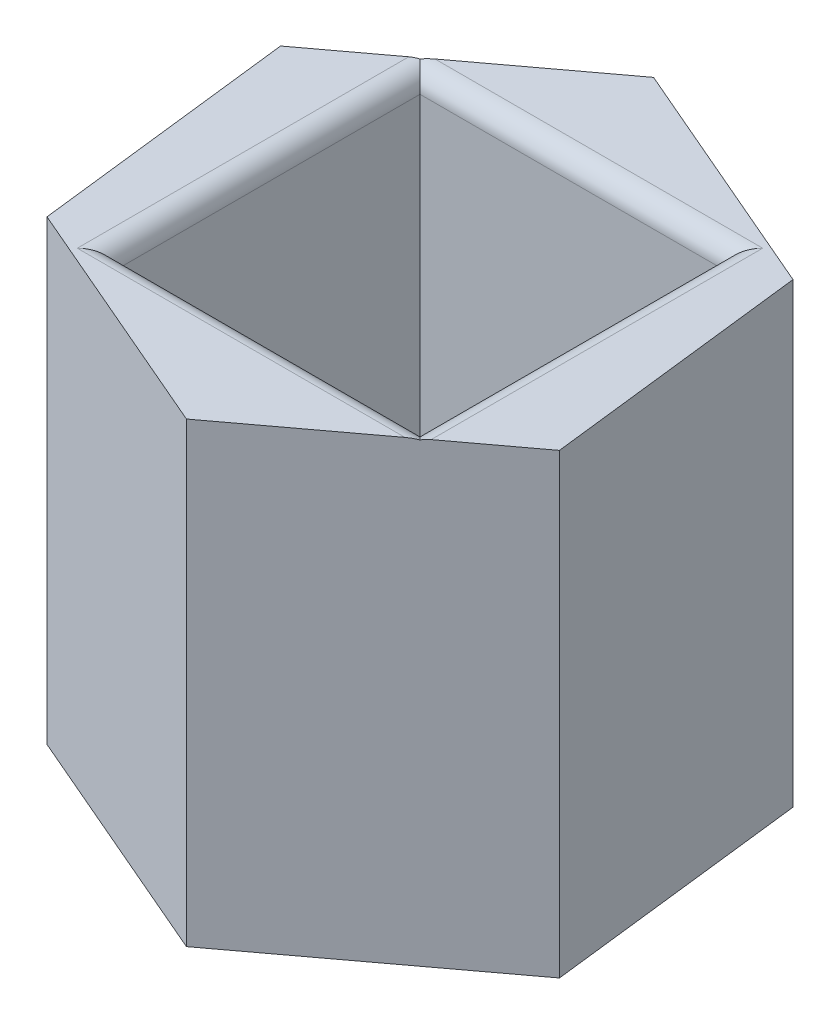
ISO-10303-21;
HEADER;
FILE_DESCRIPTION(('STEP AP214'),'2;1');
FILE_NAME('part.step','',(''),(''),'','','');
FILE_SCHEMA(('AUTOMOTIVE_DESIGN { 1 0 10303 214 1 1 1 1 }'));
ENDSEC;
DATA;
#1=APPLICATION_CONTEXT('core data for automotive mechanical design processes');
#2=APPLICATION_PROTOCOL_DEFINITION('international standard','automotive_design',2000,#1);
#3=PRODUCT_CONTEXT('',#1,'mechanical');
#4=PRODUCT('Part','Part','',(#3));
#5=PRODUCT_RELATED_PRODUCT_CATEGORY('part','',(#4));
#6=PRODUCT_DEFINITION_FORMATION('','',#4);
#7=PRODUCT_DEFINITION_CONTEXT('part definition',#1,'design');
#8=PRODUCT_DEFINITION('design','',#6,#7);
#9=PRODUCT_DEFINITION_SHAPE('','',#8);
#10=(LENGTH_UNIT() NAMED_UNIT(*) SI_UNIT(.MILLI.,.METRE.));
#11=(NAMED_UNIT(*) PLANE_ANGLE_UNIT() SI_UNIT($,.RADIAN.));
#12=(NAMED_UNIT(*) SI_UNIT($,.STERADIAN.) SOLID_ANGLE_UNIT());
#13=UNCERTAINTY_MEASURE_WITH_UNIT(LENGTH_MEASURE(1.E-05),#10,'distance_accuracy_value','');
#14=(GEOMETRIC_REPRESENTATION_CONTEXT(3) GLOBAL_UNCERTAINTY_ASSIGNED_CONTEXT((#13)) GLOBAL_UNIT_ASSIGNED_CONTEXT((#10,
#11,#12)) REPRESENTATION_CONTEXT('',''));
#15=CARTESIAN_POINT('',(0.,0.,0.));
#16=DIRECTION('',(0.,0.,1.));
#17=DIRECTION('',(1.,0.,0.));
#18=AXIS2_PLACEMENT_3D('',#15,#16,#17);
#19=CARTESIAN_POINT('',(0.,6.,0.));
#20=DIRECTION('',(0.,1.,0.));
#21=DIRECTION('',(0.,0.,1.));
#22=AXIS2_PLACEMENT_3D('',#19,#20,#21);
#23=PLANE('',#22);
#24=DIRECTION('',(1.,0.,0.));
#25=VECTOR('',#24,1.);
#26=CARTESIAN_POINT('',(0.,6.,-2.25));
#27=LINE('',#26,#25);
#28=CARTESIAN_POINT('',(-2.05318407785259,6.,-2.25));
#29=VERTEX_POINT('',#28);
#30=CARTESIAN_POINT('',(2.25,6.,-2.25));
#31=VERTEX_POINT('',#30);
#32=EDGE_CURVE('E289',#29,#31,#27,.T.);
#33=ORIENTED_EDGE('',*,*,#32,.T.);
#34=DIRECTION('',(0.,0.,-1.));
#35=VECTOR('',#34,1.);
#36=CARTESIAN_POINT('',(2.25,6.,2.));
#37=LINE('',#36,#35);
#38=CARTESIAN_POINT('',(2.25,6.,2.1032376772573));
#39=VERTEX_POINT('',#38);
#40=EDGE_CURVE('E292',#31,#39,#37,.F.);
#41=ORIENTED_EDGE('',*,*,#40,.T.);
#42=DIRECTION('',(0.801658028534698,0.,-0.597782908158021));
#43=VECTOR('',#42,1.);
#44=CARTESIAN_POINT('',(0.409031595509729,6.,3.47601685178233));
#45=LINE('',#44,#43);
#46=CARTESIAN_POINT('',(3.21483469538117,6.,1.38377667322926));
#47=VERTEX_POINT('',#46);
#48=EDGE_CURVE('E215',#39,#47,#45,.T.);
#49=ORIENTED_EDGE('',*,*,#48,.T.);
#50=DIRECTION('',(-0.116866170145637,0.,-0.99314767193781));
#51=VECTOR('',#50,1.);
#52=CARTESIAN_POINT('',(3.21483469538117,6.,1.38377667322926));
#53=LINE('',#52,#51);
#54=CARTESIAN_POINT('',(2.80580309987144,6.,-2.09224017855307));
#55=VERTEX_POINT('',#54);
#56=EDGE_CURVE('E214',#47,#55,#53,.T.);
#57=ORIENTED_EDGE('',*,*,#56,.T.);
#58=DIRECTION('',(-0.918524198680335,0.,-0.395364763779788));
#59=VECTOR('',#58,1.);
#60=CARTESIAN_POINT('',(2.80580309987144,6.,-2.09224017855307));
#61=LINE('',#60,#59);
#62=CARTESIAN_POINT('',(-0.409031595509729,6.,-3.47601685178233));
#63=VERTEX_POINT('',#62);
#64=EDGE_CURVE('E218',#55,#63,#61,.T.);
#65=ORIENTED_EDGE('',*,*,#64,.T.);
#66=DIRECTION('',(-0.801658028534698,0.,0.597782908158021));
#67=VECTOR('',#66,1.);
#68=CARTESIAN_POINT('',(-0.409031595509729,6.,-3.47601685178233));
#69=LINE('',#68,#67);
#70=EDGE_CURVE('E222',#63,#29,#69,.T.);
#71=ORIENTED_EDGE('',*,*,#70,.T.);
#72=EDGE_LOOP('',(#33,#41,#49,#57,#65,#71));
#73=FACE_BOUND('',#72,.T.);
#74=ADVANCED_FACE('F60',(#73),#23,.T.);
#75=CARTESIAN_POINT('',(0.409031595509729,6.,3.47601685178233));
#76=DIRECTION('',(-0.597782908158021,0.,-0.801658028534698));
#77=DIRECTION('',(-0.801658028534698,0.,0.597782908158021));
#78=AXIS2_PLACEMENT_3D('',#75,#76,#77);
#79=PLANE('',#78);
#80=CARTESIAN_POINT('',(2.25,5.75,2.1032376772573));
#81=DIRECTION('',(-0.597782908158021,0.,-0.801658028534698));
#82=DIRECTION('',(-0.801658028534698,0.,0.597782908158021));
#83=AXIS2_PLACEMENT_3D('',#80,#81,#82);
#84=ELLIPSE('',#83,0.311853672141174,0.25);
#85=CARTESIAN_POINT('',(2.1659284316842,5.98543995285618,2.1659284316842));
#86=VERTEX_POINT('',#85);
#87=EDGE_CURVE('E276',#39,#86,#84,.F.);
#88=ORIENTED_EDGE('',*,*,#87,.T.);
#89=CARTESIAN_POINT('',(2.05318407785259,5.75,2.25));
#90=DIRECTION('',(-0.597782908158021,0.,-0.801658028534698));
#91=DIRECTION('',(-0.801658028534698,0.,0.597782908158021));
#92=AXIS2_PLACEMENT_3D('',#89,#90,#91);
#93=ELLIPSE('',#92,0.418212024111458,0.25);
#94=CARTESIAN_POINT('',(2.05318407785259,6.,2.25));
#95=VERTEX_POINT('',#94);
#96=EDGE_CURVE('E279',#86,#95,#93,.F.);
#97=ORIENTED_EDGE('',*,*,#96,.T.);
#98=CARTESIAN_POINT('',(0.409031595509729,6.,3.47601685178233));
#99=VERTEX_POINT('',#98);
#100=EDGE_CURVE('E210',#99,#95,#45,.T.);
#101=ORIENTED_EDGE('',*,*,#100,.F.);
#102=DIRECTION('',(0.,-1.,0.));
#103=VECTOR('',#102,1.);
#104=CARTESIAN_POINT('',(0.409031595509729,6.,3.47601685178233));
#105=LINE('',#104,#103);
#106=CARTESIAN_POINT('',(0.409031595509729,0.,3.47601685178233));
#107=VERTEX_POINT('',#106);
#108=EDGE_CURVE('E232',#99,#107,#105,.T.);
#109=ORIENTED_EDGE('',*,*,#108,.T.);
#110=DIRECTION('',(0.801658028534698,0.,-0.597782908158021));
#111=VECTOR('',#110,1.);
#112=CARTESIAN_POINT('',(0.409031595509729,0.,3.47601685178233));
#113=LINE('',#112,#111);
#114=CARTESIAN_POINT('',(3.21483469538117,0.,1.38377667322926));
#115=VERTEX_POINT('',#114);
#116=EDGE_CURVE('E204',#107,#115,#113,.T.);
#117=ORIENTED_EDGE('',*,*,#116,.T.);
#118=DIRECTION('',(0.,-1.,0.));
#119=VECTOR('',#118,1.);
#120=CARTESIAN_POINT('',(3.21483469538117,6.,1.38377667322926));
#121=LINE('',#120,#119);
#122=EDGE_CURVE('E270',#47,#115,#121,.T.);
#123=ORIENTED_EDGE('',*,*,#122,.F.);
#124=ORIENTED_EDGE('',*,*,#48,.F.);
#125=EDGE_LOOP('',(#88,#97,#101,#109,#117,#123,#124));
#126=FACE_BOUND('',#125,.T.);
#127=ADVANCED_FACE('F338',(#126),#79,.F.);
#128=CARTESIAN_POINT('',(3.21483469538117,6.,1.38377667322926));
#129=DIRECTION('',(-0.99314767193781,0.,0.116866170145637));
#130=DIRECTION('',(0.116866170145637,0.,0.99314767193781));
#131=AXIS2_PLACEMENT_3D('',#128,#129,#130);
#132=PLANE('',#131);
#133=DIRECTION('',(-0.116866170145637,0.,-0.99314767193781));
#134=VECTOR('',#133,1.);
#135=CARTESIAN_POINT('',(3.21483469538117,0.,1.38377667322926));
#136=LINE('',#135,#134);
#137=CARTESIAN_POINT('',(2.80580309987144,0.,-2.09224017855307));
#138=VERTEX_POINT('',#137);
#139=EDGE_CURVE('E236',#115,#138,#136,.T.);
#140=ORIENTED_EDGE('',*,*,#139,.T.);
#141=DIRECTION('',(0.,-1.,0.));
#142=VECTOR('',#141,1.);
#143=CARTESIAN_POINT('',(2.80580309987144,6.,-2.09224017855307));
#144=LINE('',#143,#142);
#145=EDGE_CURVE('E266',#55,#138,#144,.T.);
#146=ORIENTED_EDGE('',*,*,#145,.F.);
#147=ORIENTED_EDGE('',*,*,#56,.F.);
#148=ORIENTED_EDGE('',*,*,#122,.T.);
#149=EDGE_LOOP('',(#140,#146,#147,#148));
#150=FACE_BOUND('',#149,.T.);
#151=ADVANCED_FACE('F346',(#150),#132,.F.);
#152=CARTESIAN_POINT('',(2.80580309987144,6.,-2.09224017855307));
#153=DIRECTION('',(-0.395364763779788,0.,0.918524198680335));
#154=DIRECTION('',(0.918524198680335,0.,0.395364763779788));
#155=AXIS2_PLACEMENT_3D('',#152,#153,#154);
#156=PLANE('',#155);
#157=DIRECTION('',(-0.918524198680335,0.,-0.395364763779788));
#158=VECTOR('',#157,1.);
#159=CARTESIAN_POINT('',(2.80580309987144,0.,-2.09224017855307));
#160=LINE('',#159,#158);
#161=CARTESIAN_POINT('',(-0.409031595509729,0.,-3.47601685178233));
#162=VERTEX_POINT('',#161);
#163=EDGE_CURVE('E239',#138,#162,#160,.T.);
#164=ORIENTED_EDGE('',*,*,#163,.T.);
#165=DIRECTION('',(0.,-1.,0.));
#166=VECTOR('',#165,1.);
#167=CARTESIAN_POINT('',(-0.409031595509729,6.,-3.47601685178233));
#168=LINE('',#167,#166);
#169=EDGE_CURVE('E262',#63,#162,#168,.T.);
#170=ORIENTED_EDGE('',*,*,#169,.F.);
#171=ORIENTED_EDGE('',*,*,#64,.F.);
#172=ORIENTED_EDGE('',*,*,#145,.T.);
#173=EDGE_LOOP('',(#164,#170,#171,#172));
#174=FACE_BOUND('',#173,.T.);
#175=ADVANCED_FACE('F389',(#174),#156,.F.);
#176=CARTESIAN_POINT('',(-0.409031595509729,6.,-3.47601685178233));
#177=DIRECTION('',(0.597782908158021,0.,0.801658028534698));
#178=DIRECTION('',(0.801658028534698,0.,-0.597782908158021));
#179=AXIS2_PLACEMENT_3D('',#176,#177,#178);
#180=PLANE('',#179);
#181=CARTESIAN_POINT('',(-2.25,5.75,-2.1032376772573));
#182=DIRECTION('',(0.597782908158021,0.,0.801658028534698));
#183=DIRECTION('',(0.801658028534698,0.,-0.597782908158021));
#184=AXIS2_PLACEMENT_3D('',#181,#182,#183);
#185=ELLIPSE('',#184,0.311853672141174,0.25);
#186=CARTESIAN_POINT('',(-2.25,6.,-2.1032376772573));
#187=VERTEX_POINT('',#186);
#188=CARTESIAN_POINT('',(-2.1659284316842,5.98543995285618,-2.1659284316842));
#189=VERTEX_POINT('',#188);
#190=EDGE_CURVE('E78',#187,#189,#185,.F.);
#191=ORIENTED_EDGE('',*,*,#190,.T.);
#192=CARTESIAN_POINT('',(-2.05318407785259,5.75,-2.25));
#193=DIRECTION('',(0.597782908158021,0.,0.801658028534698));
#194=DIRECTION('',(0.801658028534698,0.,-0.597782908158021));
#195=AXIS2_PLACEMENT_3D('',#192,#193,#194);
#196=ELLIPSE('',#195,0.418212024111458,0.25);
#197=EDGE_CURVE('E70',#189,#29,#196,.F.);
#198=ORIENTED_EDGE('',*,*,#197,.T.);
#199=ORIENTED_EDGE('',*,*,#70,.F.);
#200=ORIENTED_EDGE('',*,*,#169,.T.);
#201=DIRECTION('',(-0.801658028534698,0.,0.597782908158021));
#202=VECTOR('',#201,1.);
#203=CARTESIAN_POINT('',(-0.409031595509729,0.,-3.47601685178233));
#204=LINE('',#203,#202);
#205=CARTESIAN_POINT('',(-3.21483469538117,0.,-1.38377667322926));
#206=VERTEX_POINT('',#205);
#207=EDGE_CURVE('E242',#162,#206,#204,.T.);
#208=ORIENTED_EDGE('',*,*,#207,.T.);
#209=DIRECTION('',(0.,-1.,0.));
#210=VECTOR('',#209,1.);
#211=CARTESIAN_POINT('',(-3.21483469538117,6.,-1.38377667322926));
#212=LINE('',#211,#210);
#213=CARTESIAN_POINT('',(-3.21483469538117,6.,-1.38377667322926));
#214=VERTEX_POINT('',#213);
#215=EDGE_CURVE('E258',#214,#206,#212,.T.);
#216=ORIENTED_EDGE('',*,*,#215,.F.);
#217=EDGE_CURVE('E221',#187,#214,#69,.T.);
#218=ORIENTED_EDGE('',*,*,#217,.F.);
#219=EDGE_LOOP('',(#191,#198,#199,#200,#208,#216,#218));
#220=FACE_BOUND('',#219,.T.);
#221=ADVANCED_FACE('F373',(#220),#180,.F.);
#222=CARTESIAN_POINT('',(-3.21483469538117,6.,-1.38377667322926));
#223=DIRECTION('',(0.99314767193781,0.,-0.116866170145637));
#224=DIRECTION('',(-0.116866170145637,0.,-0.99314767193781));
#225=AXIS2_PLACEMENT_3D('',#222,#223,#224);
#226=PLANE('',#225);
#227=DIRECTION('',(0.116866170145637,0.,0.99314767193781));
#228=VECTOR('',#227,1.);
#229=CARTESIAN_POINT('',(-3.21483469538117,0.,-1.38377667322926));
#230=LINE('',#229,#228);
#231=CARTESIAN_POINT('',(-2.80580309987144,0.,2.09224017855307));
#232=VERTEX_POINT('',#231);
#233=EDGE_CURVE('E245',#206,#232,#230,.T.);
#234=ORIENTED_EDGE('',*,*,#233,.T.);
#235=DIRECTION('',(0.,-1.,0.));
#236=VECTOR('',#235,1.);
#237=CARTESIAN_POINT('',(-2.80580309987144,6.,2.09224017855307));
#238=LINE('',#237,#236);
#239=CARTESIAN_POINT('',(-2.80580309987144,6.,2.09224017855307));
#240=VERTEX_POINT('',#239);
#241=EDGE_CURVE('E254',#240,#232,#238,.T.);
#242=ORIENTED_EDGE('',*,*,#241,.F.);
#243=DIRECTION('',(0.116866170145637,0.,0.99314767193781));
#244=VECTOR('',#243,1.);
#245=CARTESIAN_POINT('',(-3.21483469538117,6.,-1.38377667322926));
#246=LINE('',#245,#244);
#247=EDGE_CURVE('E226',#214,#240,#246,.T.);
#248=ORIENTED_EDGE('',*,*,#247,.F.);
#249=ORIENTED_EDGE('',*,*,#215,.T.);
#250=EDGE_LOOP('',(#234,#242,#248,#249));
#251=FACE_BOUND('',#250,.T.);
#252=ADVANCED_FACE('F362',(#251),#226,.F.);
#253=CARTESIAN_POINT('',(-2.80580309987144,6.,2.09224017855307));
#254=DIRECTION('',(0.395364763779788,0.,-0.918524198680335));
#255=DIRECTION('',(-0.918524198680335,0.,-0.395364763779788));
#256=AXIS2_PLACEMENT_3D('',#253,#254,#255);
#257=PLANE('',#256);
#258=DIRECTION('',(0.918524198680335,0.,0.395364763779788));
#259=VECTOR('',#258,1.);
#260=CARTESIAN_POINT('',(-2.80580309987144,0.,2.09224017855307));
#261=LINE('',#260,#259);
#262=EDGE_CURVE('E248',#232,#107,#261,.T.);
#263=ORIENTED_EDGE('',*,*,#262,.T.);
#264=ORIENTED_EDGE('',*,*,#108,.F.);
#265=DIRECTION('',(0.918524198680335,0.,0.395364763779788));
#266=VECTOR('',#265,1.);
#267=CARTESIAN_POINT('',(-2.80580309987144,6.,2.09224017855307));
#268=LINE('',#267,#266);
#269=EDGE_CURVE('E229',#240,#99,#268,.T.);
#270=ORIENTED_EDGE('',*,*,#269,.F.);
#271=ORIENTED_EDGE('',*,*,#241,.T.);
#272=EDGE_LOOP('',(#263,#264,#270,#271));
#273=FACE_BOUND('',#272,.T.);
#274=ADVANCED_FACE('F353',(#273),#257,.F.);
#275=ORIENTED_EDGE('',*,*,#100,.T.);
#276=DIRECTION('',(1.,0.,0.));
#277=VECTOR('',#276,1.);
#278=CARTESIAN_POINT('',(-2.,6.,2.25));
#279=LINE('',#278,#277);
#280=CARTESIAN_POINT('',(-2.25,6.,2.25));
#281=VERTEX_POINT('',#280);
#282=EDGE_CURVE('E285',#95,#281,#279,.F.);
#283=ORIENTED_EDGE('',*,*,#282,.T.);
#284=DIRECTION('',(0.,0.,-1.));
#285=VECTOR('',#284,1.);
#286=CARTESIAN_POINT('',(-2.25,6.,0.));
#287=LINE('',#286,#285);
#288=EDGE_CURVE('E282',#281,#187,#287,.T.);
#289=ORIENTED_EDGE('',*,*,#288,.T.);
#290=ORIENTED_EDGE('',*,*,#217,.T.);
#291=ORIENTED_EDGE('',*,*,#247,.T.);
#292=ORIENTED_EDGE('',*,*,#269,.T.);
#293=EDGE_LOOP('',(#275,#283,#289,#290,#291,#292));
#294=FACE_BOUND('',#293,.T.);
#295=ADVANCED_FACE('F341',(#294),#23,.T.);
#296=CARTESIAN_POINT('',(0.,0.,0.));
#297=DIRECTION('',(0.,1.,0.));
#298=DIRECTION('',(0.,0.,1.));
#299=AXIS2_PLACEMENT_3D('',#296,#297,#298);
#300=PLANE('',#299);
#301=ORIENTED_EDGE('',*,*,#116,.F.);
#302=ORIENTED_EDGE('',*,*,#262,.F.);
#303=ORIENTED_EDGE('',*,*,#233,.F.);
#304=ORIENTED_EDGE('',*,*,#207,.F.);
#305=ORIENTED_EDGE('',*,*,#163,.F.);
#306=ORIENTED_EDGE('',*,*,#139,.F.);
#307=EDGE_LOOP('',(#301,#302,#303,#304,#305,#306));
#308=FACE_BOUND('',#307,.T.);
#309=ADVANCED_FACE('F352',(#308),#300,.F.);
#310=CARTESIAN_POINT('',(0.,1.,2.));
#311=DIRECTION('',(0.,0.,1.));
#312=DIRECTION('',(1.,0.,0.));
#313=AXIS2_PLACEMENT_3D('',#310,#311,#312);
#314=PLANE('',#313);
#315=DIRECTION('',(0.,1.,0.));
#316=VECTOR('',#315,1.);
#317=CARTESIAN_POINT('',(-2.,1.,2.));
#318=LINE('',#317,#316);
#319=CARTESIAN_POINT('',(-2.,1.,2.));
#320=VERTEX_POINT('',#319);
#321=CARTESIAN_POINT('',(-2.,5.75,2.));
#322=VERTEX_POINT('',#321);
#323=EDGE_CURVE('E201',#320,#322,#318,.T.);
#324=ORIENTED_EDGE('',*,*,#323,.T.);
#325=DIRECTION('',(1.,0.,0.));
#326=VECTOR('',#325,1.);
#327=CARTESIAN_POINT('',(2.,5.75,2.));
#328=LINE('',#327,#326);
#329=CARTESIAN_POINT('',(2.,5.75,2.));
#330=VERTEX_POINT('',#329);
#331=EDGE_CURVE('E174',#322,#330,#328,.T.);
#332=ORIENTED_EDGE('',*,*,#331,.T.);
#333=DIRECTION('',(0.,1.,0.));
#334=VECTOR('',#333,1.);
#335=CARTESIAN_POINT('',(2.,1.,2.));
#336=LINE('',#335,#334);
#337=CARTESIAN_POINT('',(2.,1.,2.));
#338=VERTEX_POINT('',#337);
#339=EDGE_CURVE('E167',#338,#330,#336,.T.);
#340=ORIENTED_EDGE('',*,*,#339,.F.);
#341=DIRECTION('',(1.,0.,0.));
#342=VECTOR('',#341,1.);
#343=CARTESIAN_POINT('',(0.,1.,2.));
#344=LINE('',#343,#342);
#345=EDGE_CURVE('E172',#320,#338,#344,.T.);
#346=ORIENTED_EDGE('',*,*,#345,.F.);
#347=EDGE_LOOP('',(#324,#332,#340,#346));
#348=FACE_BOUND('',#347,.T.);
#349=ADVANCED_FACE('F170',(#348),#314,.F.);
#350=CARTESIAN_POINT('',(-2.,1.,0.));
#351=DIRECTION('',(1.,0.,0.));
#352=DIRECTION('',(0.,0.,-1.));
#353=AXIS2_PLACEMENT_3D('',#350,#351,#352);
#354=PLANE('',#353);
#355=DIRECTION('',(0.,1.,0.));
#356=VECTOR('',#355,1.);
#357=CARTESIAN_POINT('',(-2.,1.,-2.));
#358=LINE('',#357,#356);
#359=CARTESIAN_POINT('',(-2.,1.,-2.));
#360=VERTEX_POINT('',#359);
#361=CARTESIAN_POINT('',(-2.,5.75,-2.));
#362=VERTEX_POINT('',#361);
#363=EDGE_CURVE('E205',#360,#362,#358,.T.);
#364=ORIENTED_EDGE('',*,*,#363,.T.);
#365=DIRECTION('',(0.,0.,-1.));
#366=VECTOR('',#365,1.);
#367=CARTESIAN_POINT('',(-2.,5.75,0.));
#368=LINE('',#367,#366);
#369=EDGE_CURVE('E12',#362,#322,#368,.F.);
#370=ORIENTED_EDGE('',*,*,#369,.T.);
#371=ORIENTED_EDGE('',*,*,#323,.F.);
#372=DIRECTION('',(0.,0.,-1.));
#373=VECTOR('',#372,1.);
#374=CARTESIAN_POINT('',(-2.,1.,0.));
#375=LINE('',#374,#373);
#376=EDGE_CURVE('E178',#320,#360,#375,.T.);
#377=ORIENTED_EDGE('',*,*,#376,.T.);
#378=EDGE_LOOP('',(#364,#370,#371,#377));
#379=FACE_BOUND('',#378,.T.);
#380=ADVANCED_FACE('F327',(#379),#354,.T.);
#381=CARTESIAN_POINT('',(0.,1.,-2.));
#382=DIRECTION('',(0.,0.,1.));
#383=DIRECTION('',(1.,0.,0.));
#384=AXIS2_PLACEMENT_3D('',#381,#382,#383);
#385=PLANE('',#384);
#386=DIRECTION('',(0.,1.,0.));
#387=VECTOR('',#386,1.);
#388=CARTESIAN_POINT('',(2.,1.,-2.));
#389=LINE('',#388,#387);
#390=CARTESIAN_POINT('',(2.,1.,-2.));
#391=VERTEX_POINT('',#390);
#392=CARTESIAN_POINT('',(2.,5.75,-2.));
#393=VERTEX_POINT('',#392);
#394=EDGE_CURVE('E177',#391,#393,#389,.T.);
#395=ORIENTED_EDGE('',*,*,#394,.T.);
#396=DIRECTION('',(1.,0.,0.));
#397=VECTOR('',#396,1.);
#398=CARTESIAN_POINT('',(0.,5.75,-2.));
#399=LINE('',#398,#397);
#400=EDGE_CURVE('E86',#393,#362,#399,.F.);
#401=ORIENTED_EDGE('',*,*,#400,.T.);
#402=ORIENTED_EDGE('',*,*,#363,.F.);
#403=DIRECTION('',(1.,0.,0.));
#404=VECTOR('',#403,1.);
#405=CARTESIAN_POINT('',(0.,1.,-2.));
#406=LINE('',#405,#404);
#407=EDGE_CURVE('E186',#360,#391,#406,.T.);
#408=ORIENTED_EDGE('',*,*,#407,.T.);
#409=EDGE_LOOP('',(#395,#401,#402,#408));
#410=FACE_BOUND('',#409,.T.);
#411=ADVANCED_FACE('F328',(#410),#385,.T.);
#412=CARTESIAN_POINT('',(2.,1.,0.));
#413=DIRECTION('',(1.,0.,0.));
#414=DIRECTION('',(0.,0.,-1.));
#415=AXIS2_PLACEMENT_3D('',#412,#413,#414);
#416=PLANE('',#415);
#417=ORIENTED_EDGE('',*,*,#339,.T.);
#418=DIRECTION('',(0.,0.,-1.));
#419=VECTOR('',#418,1.);
#420=CARTESIAN_POINT('',(2.,5.75,-2.));
#421=LINE('',#420,#419);
#422=EDGE_CURVE('E295',#330,#393,#421,.T.);
#423=ORIENTED_EDGE('',*,*,#422,.T.);
#424=ORIENTED_EDGE('',*,*,#394,.F.);
#425=DIRECTION('',(0.,0.,-1.));
#426=VECTOR('',#425,1.);
#427=CARTESIAN_POINT('',(2.,1.,0.));
#428=LINE('',#427,#426);
#429=EDGE_CURVE('E182',#338,#391,#428,.T.);
#430=ORIENTED_EDGE('',*,*,#429,.F.);
#431=EDGE_LOOP('',(#417,#423,#424,#430));
#432=FACE_BOUND('',#431,.T.);
#433=ADVANCED_FACE('F183',(#432),#416,.F.);
#434=CARTESIAN_POINT('',(0.,1.,0.));
#435=DIRECTION('',(0.,1.,0.));
#436=DIRECTION('',(0.,0.,1.));
#437=AXIS2_PLACEMENT_3D('',#434,#435,#436);
#438=PLANE('',#437);
#439=ORIENTED_EDGE('',*,*,#345,.T.);
#440=ORIENTED_EDGE('',*,*,#429,.T.);
#441=ORIENTED_EDGE('',*,*,#407,.F.);
#442=ORIENTED_EDGE('',*,*,#376,.F.);
#443=EDGE_LOOP('',(#439,#440,#441,#442));
#444=FACE_BOUND('',#443,.T.);
#445=ADVANCED_FACE('F189',(#444),#438,.T.);
#446=CARTESIAN_POINT('',(0.,5.75,-2.25));
#447=DIRECTION('',(1.,0.,0.));
#448=DIRECTION('',(0.,0.,-1.));
#449=AXIS2_PLACEMENT_3D('',#446,#447,#448);
#450=CYLINDRICAL_SURFACE('',#449,0.25);
#451=ORIENTED_EDGE('',*,*,#32,.F.);
#452=ORIENTED_EDGE('',*,*,#197,.F.);
#453=CARTESIAN_POINT('',(-2.25,5.75,-2.25));
#454=DIRECTION('',(0.707106781186547,0.,-0.707106781186547));
#455=DIRECTION('',(-0.707106781186547,0.,-0.707106781186547));
#456=AXIS2_PLACEMENT_3D('',#453,#454,#455);
#457=ELLIPSE('',#456,0.353553390593274,0.25);
#458=EDGE_CURVE('E64',#362,#189,#457,.F.);
#459=ORIENTED_EDGE('',*,*,#458,.F.);
#460=ORIENTED_EDGE('',*,*,#400,.F.);
#461=CARTESIAN_POINT('',(2.25,5.75,-2.25));
#462=DIRECTION('',(0.707106781186547,0.,0.707106781186547));
#463=DIRECTION('',(-0.707106781186547,0.,0.707106781186547));
#464=AXIS2_PLACEMENT_3D('',#461,#462,#463);
#465=ELLIPSE('',#464,0.353553390593274,0.25);
#466=EDGE_CURVE('E195',#31,#393,#465,.T.);
#467=ORIENTED_EDGE('',*,*,#466,.F.);
#468=EDGE_LOOP('',(#451,#452,#459,#460,#467));
#469=FACE_BOUND('',#468,.T.);
#470=ADVANCED_FACE('F62',(#469),#450,.T.);
#471=CARTESIAN_POINT('',(-2.25,5.75,0.));
#472=DIRECTION('',(0.,0.,-1.));
#473=DIRECTION('',(-1.,0.,0.));
#474=AXIS2_PLACEMENT_3D('',#471,#472,#473);
#475=CYLINDRICAL_SURFACE('',#474,0.25);
#476=ORIENTED_EDGE('',*,*,#190,.F.);
#477=ORIENTED_EDGE('',*,*,#288,.F.);
#478=CARTESIAN_POINT('',(-2.25,5.75,2.25));
#479=DIRECTION('',(-0.707106781186547,0.,-0.707106781186547));
#480=DIRECTION('',(-0.707106781186547,0.,0.707106781186547));
#481=AXIS2_PLACEMENT_3D('',#478,#479,#480);
#482=ELLIPSE('',#481,0.353553390593274,0.25);
#483=EDGE_CURVE('E307',#322,#281,#482,.F.);
#484=ORIENTED_EDGE('',*,*,#483,.F.);
#485=ORIENTED_EDGE('',*,*,#369,.F.);
#486=ORIENTED_EDGE('',*,*,#458,.T.);
#487=EDGE_LOOP('',(#476,#477,#484,#485,#486));
#488=FACE_BOUND('',#487,.T.);
#489=ADVANCED_FACE('F324',(#488),#475,.T.);
#490=CARTESIAN_POINT('',(2.25,5.75,0.));
#491=DIRECTION('',(0.,0.,1.));
#492=DIRECTION('',(1.,0.,0.));
#493=AXIS2_PLACEMENT_3D('',#490,#491,#492);
#494=CYLINDRICAL_SURFACE('',#493,0.25);
#495=ORIENTED_EDGE('',*,*,#466,.T.);
#496=ORIENTED_EDGE('',*,*,#422,.F.);
#497=CARTESIAN_POINT('',(2.25,5.75,2.25));
#498=DIRECTION('',(-0.707106781186547,0.,0.707106781186547));
#499=DIRECTION('',(0.707106781186547,0.,0.707106781186547));
#500=AXIS2_PLACEMENT_3D('',#497,#498,#499);
#501=ELLIPSE('',#500,0.353553390593274,0.25);
#502=EDGE_CURVE('E304',#86,#330,#501,.T.);
#503=ORIENTED_EDGE('',*,*,#502,.F.);
#504=ORIENTED_EDGE('',*,*,#87,.F.);
#505=ORIENTED_EDGE('',*,*,#40,.F.);
#506=EDGE_LOOP('',(#495,#496,#503,#504,#505));
#507=FACE_BOUND('',#506,.T.);
#508=ADVANCED_FACE('F315',(#507),#494,.T.);
#509=CARTESIAN_POINT('',(0.,5.75,2.25));
#510=DIRECTION('',(-1.,0.,0.));
#511=DIRECTION('',(0.,0.,1.));
#512=AXIS2_PLACEMENT_3D('',#509,#510,#511);
#513=CYLINDRICAL_SURFACE('',#512,0.25);
#514=ORIENTED_EDGE('',*,*,#483,.T.);
#515=ORIENTED_EDGE('',*,*,#282,.F.);
#516=ORIENTED_EDGE('',*,*,#96,.F.);
#517=ORIENTED_EDGE('',*,*,#502,.T.);
#518=ORIENTED_EDGE('',*,*,#331,.F.);
#519=EDGE_LOOP('',(#514,#515,#516,#517,#518));
#520=FACE_BOUND('',#519,.T.);
#521=ADVANCED_FACE('F371',(#520),#513,.T.);
#522=CLOSED_SHELL('',(#74,#127,#151,#175,#221,#252,#274,#295,#309,#349,#380,#411,#433,#445,#470,
#489,#508,#521));
#523=MANIFOLD_SOLID_BREP('B2',#522);
#524=ADVANCED_BREP_SHAPE_REPRESENTATION('',(#18,#523),#14);
#525=SHAPE_DEFINITION_REPRESENTATION(#9,#524);
ENDSEC;
END-ISO-10303-21;
